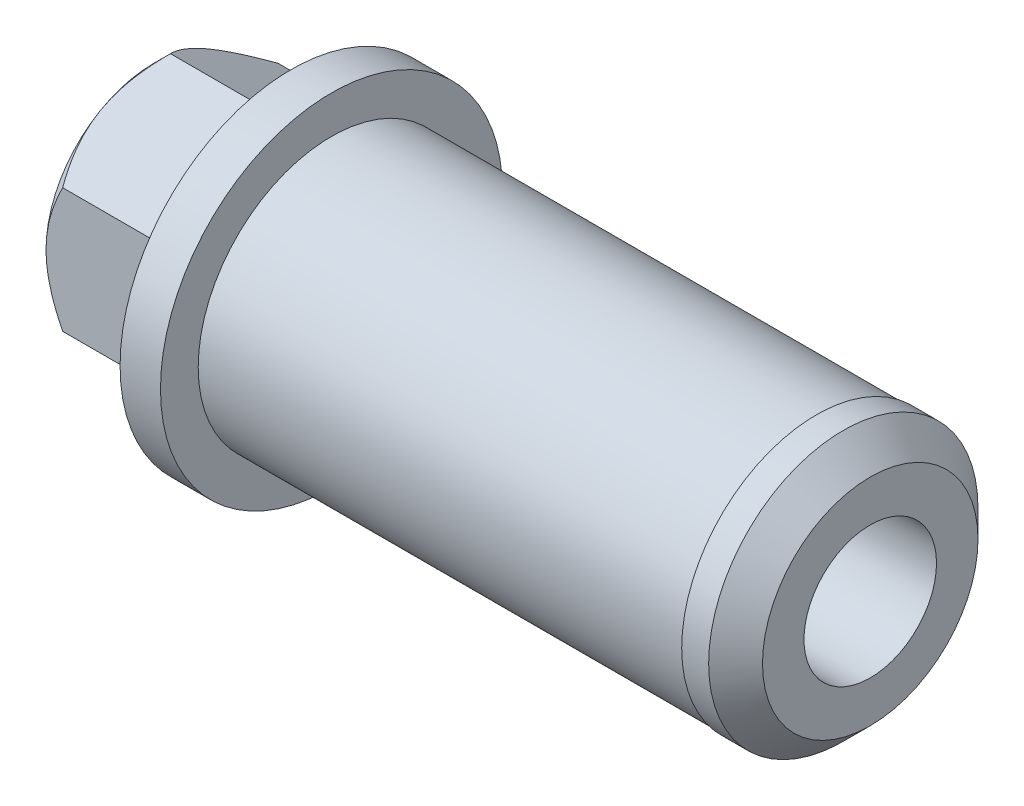
ISO-10303-21;
HEADER;
FILE_DESCRIPTION(('STEP AP214'),'2;1');
FILE_NAME('part.step','',(''),(''),'','','');
FILE_SCHEMA(('AUTOMOTIVE_DESIGN { 1 0 10303 214 1 1 1 1 }'));
ENDSEC;
DATA;
#1=APPLICATION_CONTEXT('core data for automotive mechanical design processes');
#2=APPLICATION_PROTOCOL_DEFINITION('international standard','automotive_design',2000,#1);
#3=PRODUCT_CONTEXT('',#1,'mechanical');
#4=PRODUCT('Part','Part','',(#3));
#5=PRODUCT_RELATED_PRODUCT_CATEGORY('part','',(#4));
#6=PRODUCT_DEFINITION_FORMATION('','',#4);
#7=PRODUCT_DEFINITION_CONTEXT('part definition',#1,'design');
#8=PRODUCT_DEFINITION('design','',#6,#7);
#9=PRODUCT_DEFINITION_SHAPE('','',#8);
#10=(LENGTH_UNIT() NAMED_UNIT(*) SI_UNIT(.MILLI.,.METRE.));
#11=(NAMED_UNIT(*) PLANE_ANGLE_UNIT() SI_UNIT($,.RADIAN.));
#12=(NAMED_UNIT(*) SI_UNIT($,.STERADIAN.) SOLID_ANGLE_UNIT());
#13=UNCERTAINTY_MEASURE_WITH_UNIT(LENGTH_MEASURE(1.E-05),#10,'distance_accuracy_value','');
#14=(GEOMETRIC_REPRESENTATION_CONTEXT(3) GLOBAL_UNCERTAINTY_ASSIGNED_CONTEXT((#13)) GLOBAL_UNIT_ASSIGNED_CONTEXT((#10,
#11,#12)) REPRESENTATION_CONTEXT('',''));
#15=CARTESIAN_POINT('',(0.,0.,0.));
#16=DIRECTION('',(0.,0.,1.));
#17=DIRECTION('',(1.,0.,0.));
#18=AXIS2_PLACEMENT_3D('',#15,#16,#17);
#19=CARTESIAN_POINT('',(-5.1,0.,0.));
#20=DIRECTION('',(-1.,0.,0.));
#21=DIRECTION('',(0.,0.,-1.));
#22=AXIS2_PLACEMENT_3D('',#19,#20,#21);
#23=PLANE('',#22);
#24=CARTESIAN_POINT('',(-5.1,0.,0.));
#25=DIRECTION('',(1.,0.,0.));
#26=DIRECTION('',(0.,0.,-1.));
#27=AXIS2_PLACEMENT_3D('',#24,#25,#26);
#28=CIRCLE('',#27,2.96);
#29=CARTESIAN_POINT('',(-5.1,0.,-2.96));
#30=VERTEX_POINT('',#29);
#31=EDGE_CURVE('E11',#30,#30,#28,.F.);
#32=ORIENTED_EDGE('',*,*,#31,.F.);
#33=EDGE_LOOP('',(#32));
#34=FACE_BOUND('',#33,.T.);
#35=CARTESIAN_POINT('',(-5.1,0.,0.));
#36=DIRECTION('',(-1.,0.,0.));
#37=DIRECTION('',(0.,0.,1.));
#38=AXIS2_PLACEMENT_3D('',#35,#36,#37);
#39=CIRCLE('',#38,4.);
#40=CARTESIAN_POINT('',(-5.1,0.,-4.));
#41=VERTEX_POINT('',#40);
#42=CARTESIAN_POINT('',(-5.1,-3.46410161513775,-2.));
#43=VERTEX_POINT('',#42);
#44=EDGE_CURVE('E266',#41,#43,#39,.T.);
#45=ORIENTED_EDGE('',*,*,#44,.T.);
#46=CARTESIAN_POINT('',(-5.1,-3.46410161513776,2.));
#47=VERTEX_POINT('',#46);
#48=EDGE_CURVE('E268',#43,#47,#39,.T.);
#49=ORIENTED_EDGE('',*,*,#48,.T.);
#50=CARTESIAN_POINT('',(-5.1,0.,4.));
#51=VERTEX_POINT('',#50);
#52=EDGE_CURVE('E273',#47,#51,#39,.T.);
#53=ORIENTED_EDGE('',*,*,#52,.T.);
#54=CARTESIAN_POINT('',(-5.1,3.46410161513775,2.));
#55=VERTEX_POINT('',#54);
#56=EDGE_CURVE('E113',#51,#55,#39,.T.);
#57=ORIENTED_EDGE('',*,*,#56,.T.);
#58=CARTESIAN_POINT('',(-5.1,3.46410161513776,-2.));
#59=VERTEX_POINT('',#58);
#60=EDGE_CURVE('E272',#55,#59,#39,.T.);
#61=ORIENTED_EDGE('',*,*,#60,.T.);
#62=EDGE_CURVE('E270',#59,#41,#39,.T.);
#63=ORIENTED_EDGE('',*,*,#62,.T.);
#64=EDGE_LOOP('',(#45,#49,#53,#57,#61,#63));
#65=FACE_BOUND('',#64,.T.);
#66=ADVANCED_FACE('F39',(#34,#65),#23,.T.);
#67=CARTESIAN_POINT('',(0.,0.,2.46));
#68=DIRECTION('',(1.,0.,0.));
#69=DIRECTION('',(0.,0.,1.));
#70=AXIS2_PLACEMENT_3D('',#67,#68,#69);
#71=PLANE('',#70);
#72=CARTESIAN_POINT('',(0.,0.,0.));
#73=DIRECTION('',(1.,0.,0.));
#74=DIRECTION('',(0.,0.,-1.));
#75=AXIS2_PLACEMENT_3D('',#72,#73,#74);
#76=CIRCLE('',#75,6.35);
#77=CARTESIAN_POINT('',(0.,0.,-6.35));
#78=VERTEX_POINT('',#77);
#79=EDGE_CURVE('E162',#78,#78,#76,.T.);
#80=ORIENTED_EDGE('',*,*,#79,.F.);
#81=EDGE_LOOP('',(#80));
#82=FACE_BOUND('',#81,.T.);
#83=DIRECTION('',(0.,0.500000000000001,-0.866025403784438));
#84=VECTOR('',#83,1.);
#85=CARTESIAN_POINT('',(0.,-4.61880215351701,0.));
#86=LINE('',#85,#84);
#87=CARTESIAN_POINT('',(0.,-4.61880215351701,0.));
#88=VERTEX_POINT('',#87);
#89=CARTESIAN_POINT('',(0.,-2.3094010767585,-4.));
#90=VERTEX_POINT('',#89);
#91=EDGE_CURVE('E280',#88,#90,#86,.T.);
#92=ORIENTED_EDGE('',*,*,#91,.T.);
#93=DIRECTION('',(0.,1.,0.));
#94=VECTOR('',#93,1.);
#95=CARTESIAN_POINT('',(0.,-2.3094010767585,-4.));
#96=LINE('',#95,#94);
#97=CARTESIAN_POINT('',(0.,2.30940107675851,-4.));
#98=VERTEX_POINT('',#97);
#99=EDGE_CURVE('E320',#90,#98,#96,.T.);
#100=ORIENTED_EDGE('',*,*,#99,.T.);
#101=DIRECTION('',(0.,0.5,0.866025403784439));
#102=VECTOR('',#101,1.);
#103=CARTESIAN_POINT('',(0.,2.30940107675851,-4.));
#104=LINE('',#103,#102);
#105=CARTESIAN_POINT('',(0.,4.61880215351701,0.));
#106=VERTEX_POINT('',#105);
#107=EDGE_CURVE('E316',#98,#106,#104,.T.);
#108=ORIENTED_EDGE('',*,*,#107,.T.);
#109=DIRECTION('',(0.,-0.500000000000001,0.866025403784438));
#110=VECTOR('',#109,1.);
#111=CARTESIAN_POINT('',(0.,4.61880215351701,0.));
#112=LINE('',#111,#110);
#113=CARTESIAN_POINT('',(0.,2.3094010767585,4.));
#114=VERTEX_POINT('',#113);
#115=EDGE_CURVE('E314',#106,#114,#112,.T.);
#116=ORIENTED_EDGE('',*,*,#115,.T.);
#117=DIRECTION('',(0.,-1.,0.));
#118=VECTOR('',#117,1.);
#119=CARTESIAN_POINT('',(0.,2.3094010767585,4.));
#120=LINE('',#119,#118);
#121=CARTESIAN_POINT('',(0.,-2.3094010767585,4.));
#122=VERTEX_POINT('',#121);
#123=EDGE_CURVE('E133',#114,#122,#120,.T.);
#124=ORIENTED_EDGE('',*,*,#123,.T.);
#125=DIRECTION('',(0.,-0.5,-0.866025403784438));
#126=VECTOR('',#125,1.);
#127=CARTESIAN_POINT('',(0.,-2.3094010767585,4.));
#128=LINE('',#127,#126);
#129=EDGE_CURVE('E307',#122,#88,#128,.T.);
#130=ORIENTED_EDGE('',*,*,#129,.T.);
#131=EDGE_LOOP('',(#92,#100,#108,#116,#124,#130));
#132=FACE_BOUND('',#131,.T.);
#133=ADVANCED_FACE('F245',(#82,#132),#71,.F.);
#134=CARTESIAN_POINT('',(0.,0.,0.));
#135=DIRECTION('',(-1.,0.,0.));
#136=DIRECTION('',(0.,0.,-1.));
#137=AXIS2_PLACEMENT_3D('',#134,#135,#136);
#138=CYLINDRICAL_SURFACE('',#137,2.46);
#139=CARTESIAN_POINT('',(-4.6,0.,0.));
#140=DIRECTION('',(1.,0.,0.));
#141=DIRECTION('',(0.,0.,-1.));
#142=AXIS2_PLACEMENT_3D('',#139,#140,#141);
#143=CIRCLE('',#142,2.46);
#144=CARTESIAN_POINT('',(-4.6,0.,-2.46));
#145=VERTEX_POINT('',#144);
#146=EDGE_CURVE('E47',#145,#145,#143,.T.);
#147=ORIENTED_EDGE('',*,*,#146,.F.);
#148=EDGE_LOOP('',(#147));
#149=FACE_BOUND('',#148,.T.);
#150=CARTESIAN_POINT('',(21.5,0.,0.));
#151=DIRECTION('',(1.,0.,0.));
#152=DIRECTION('',(0.,0.,-1.));
#153=AXIS2_PLACEMENT_3D('',#150,#151,#152);
#154=CIRCLE('',#153,2.46);
#155=CARTESIAN_POINT('',(21.5,0.,-2.46));
#156=VERTEX_POINT('',#155);
#157=EDGE_CURVE('E147',#156,#156,#154,.T.);
#158=ORIENTED_EDGE('',*,*,#157,.T.);
#159=EDGE_LOOP('',(#158));
#160=FACE_BOUND('',#159,.T.);
#161=ADVANCED_FACE('F243',(#149,#160),#138,.F.);
#162=CARTESIAN_POINT('',(0.,0.,0.));
#163=DIRECTION('',(-1.,0.,0.));
#164=DIRECTION('',(0.,0.,-1.));
#165=AXIS2_PLACEMENT_3D('',#162,#163,#164);
#166=CYLINDRICAL_SURFACE('',#165,6.35);
#167=ORIENTED_EDGE('',*,*,#79,.T.);
#168=EDGE_LOOP('',(#167));
#169=FACE_BOUND('',#168,.T.);
#170=CARTESIAN_POINT('',(1.5,0.,0.));
#171=DIRECTION('',(1.,0.,0.));
#172=DIRECTION('',(0.,0.,-1.));
#173=AXIS2_PLACEMENT_3D('',#170,#171,#172);
#174=CIRCLE('',#173,6.35);
#175=CARTESIAN_POINT('',(1.5,0.,-6.35));
#176=VERTEX_POINT('',#175);
#177=EDGE_CURVE('E159',#176,#176,#174,.T.);
#178=ORIENTED_EDGE('',*,*,#177,.F.);
#179=EDGE_LOOP('',(#178));
#180=FACE_BOUND('',#179,.T.);
#181=ADVANCED_FACE('F239',(#169,#180),#166,.T.);
#182=CARTESIAN_POINT('',(1.5,0.,6.35));
#183=DIRECTION('',(-1.,0.,0.));
#184=DIRECTION('',(0.,0.,-1.));
#185=AXIS2_PLACEMENT_3D('',#182,#183,#184);
#186=PLANE('',#185);
#187=ORIENTED_EDGE('',*,*,#177,.T.);
#188=EDGE_LOOP('',(#187));
#189=FACE_BOUND('',#188,.T.);
#190=CARTESIAN_POINT('',(1.5,0.,0.));
#191=DIRECTION('',(1.,0.,0.));
#192=DIRECTION('',(0.,0.,-1.));
#193=AXIS2_PLACEMENT_3D('',#190,#191,#192);
#194=CIRCLE('',#193,4.95);
#195=CARTESIAN_POINT('',(1.5,0.,-4.95));
#196=VERTEX_POINT('',#195);
#197=EDGE_CURVE('E156',#196,#196,#194,.T.);
#198=ORIENTED_EDGE('',*,*,#197,.F.);
#199=EDGE_LOOP('',(#198));
#200=FACE_BOUND('',#199,.T.);
#201=ADVANCED_FACE('F235',(#189,#200),#186,.F.);
#202=CARTESIAN_POINT('',(0.,0.,0.));
#203=DIRECTION('',(-1.,0.,0.));
#204=DIRECTION('',(0.,0.,-1.));
#205=AXIS2_PLACEMENT_3D('',#202,#203,#204);
#206=CYLINDRICAL_SURFACE('',#205,4.95);
#207=ORIENTED_EDGE('',*,*,#197,.T.);
#208=EDGE_LOOP('',(#207));
#209=FACE_BOUND('',#208,.T.);
#210=CARTESIAN_POINT('',(19.5,0.,0.));
#211=DIRECTION('',(1.,0.,0.));
#212=DIRECTION('',(0.,0.,-1.));
#213=AXIS2_PLACEMENT_3D('',#210,#211,#212);
#214=CIRCLE('',#213,4.95);
#215=CARTESIAN_POINT('',(19.5,0.,-4.95));
#216=VERTEX_POINT('',#215);
#217=EDGE_CURVE('E153',#216,#216,#214,.T.);
#218=ORIENTED_EDGE('',*,*,#217,.F.);
#219=EDGE_LOOP('',(#218));
#220=FACE_BOUND('',#219,.T.);
#221=ADVANCED_FACE('F231',(#209,#220),#206,.T.);
#222=CARTESIAN_POINT('',(19.5,0.,4.95));
#223=DIRECTION('',(1.,0.,0.));
#224=DIRECTION('',(0.,0.,1.));
#225=AXIS2_PLACEMENT_3D('',#222,#223,#224);
#226=PLANE('',#225);
#227=ORIENTED_EDGE('',*,*,#217,.T.);
#228=EDGE_LOOP('',(#227));
#229=FACE_BOUND('',#228,.T.);
#230=CARTESIAN_POINT('',(19.5,0.,0.));
#231=DIRECTION('',(1.,0.,0.));
#232=DIRECTION('',(0.,0.,-1.));
#233=AXIS2_PLACEMENT_3D('',#230,#231,#232);
#234=CIRCLE('',#233,5.);
#235=CARTESIAN_POINT('',(19.5,0.,-5.));
#236=VERTEX_POINT('',#235);
#237=EDGE_CURVE('E150',#236,#236,#234,.T.);
#238=ORIENTED_EDGE('',*,*,#237,.F.);
#239=EDGE_LOOP('',(#238));
#240=FACE_BOUND('',#239,.T.);
#241=ADVANCED_FACE('F227',(#229,#240),#226,.F.);
#242=CARTESIAN_POINT('',(0.,0.,0.));
#243=DIRECTION('',(-1.,0.,0.));
#244=DIRECTION('',(0.,0.,-1.));
#245=AXIS2_PLACEMENT_3D('',#242,#243,#244);
#246=CYLINDRICAL_SURFACE('',#245,5.);
#247=CARTESIAN_POINT('',(20.5,0.,0.));
#248=DIRECTION('',(1.,0.,0.));
#249=DIRECTION('',(0.,0.,-1.));
#250=AXIS2_PLACEMENT_3D('',#247,#248,#249);
#251=CIRCLE('',#250,5.);
#252=CARTESIAN_POINT('',(20.5,0.,-5.));
#253=VERTEX_POINT('',#252);
#254=EDGE_CURVE('E165',#253,#253,#251,.T.);
#255=ORIENTED_EDGE('',*,*,#254,.F.);
#256=EDGE_LOOP('',(#255));
#257=FACE_BOUND('',#256,.T.);
#258=ORIENTED_EDGE('',*,*,#237,.T.);
#259=EDGE_LOOP('',(#258));
#260=FACE_BOUND('',#259,.T.);
#261=ADVANCED_FACE('F223',(#257,#260),#246,.T.);
#262=CARTESIAN_POINT('',(21.5,0.,5.));
#263=DIRECTION('',(-1.,0.,0.));
#264=DIRECTION('',(0.,0.,-1.));
#265=AXIS2_PLACEMENT_3D('',#262,#263,#264);
#266=PLANE('',#265);
#267=CARTESIAN_POINT('',(21.5,0.,0.));
#268=DIRECTION('',(1.,0.,0.));
#269=DIRECTION('',(0.,0.,-1.));
#270=AXIS2_PLACEMENT_3D('',#267,#268,#269);
#271=CIRCLE('',#270,4.);
#272=CARTESIAN_POINT('',(21.5,0.,-4.));
#273=VERTEX_POINT('',#272);
#274=EDGE_CURVE('E168',#273,#273,#271,.F.);
#275=ORIENTED_EDGE('',*,*,#274,.F.);
#276=EDGE_LOOP('',(#275));
#277=FACE_BOUND('',#276,.T.);
#278=ORIENTED_EDGE('',*,*,#157,.F.);
#279=EDGE_LOOP('',(#278));
#280=FACE_BOUND('',#279,.T.);
#281=ADVANCED_FACE('F220',(#277,#280),#266,.F.);
#282=CARTESIAN_POINT('',(20.5,0.,0.));
#283=DIRECTION('',(-1.,0.,0.));
#284=DIRECTION('',(0.,0.,-1.));
#285=AXIS2_PLACEMENT_3D('',#282,#283,#284);
#286=CONICAL_SURFACE('',#285,5.,0.78539816339745);
#287=ORIENTED_EDGE('',*,*,#274,.T.);
#288=EDGE_LOOP('',(#287));
#289=FACE_BOUND('',#288,.T.);
#290=ORIENTED_EDGE('',*,*,#254,.T.);
#291=EDGE_LOOP('',(#290));
#292=FACE_BOUND('',#291,.T.);
#293=ADVANCED_FACE('F217',(#289,#292),#286,.T.);
#294=CARTESIAN_POINT('',(-5.1,-4.61880215351701,0.));
#295=DIRECTION('',(0.,0.866025403784438,0.500000000000001));
#296=DIRECTION('',(0.,0.500000000000001,-0.866025403784438));
#297=AXIS2_PLACEMENT_3D('',#294,#295,#296);
#298=PLANE('',#297);
#299=DIRECTION('',(1.,0.,0.));
#300=VECTOR('',#299,1.);
#301=CARTESIAN_POINT('',(-5.1,-2.3094010767585,-4.));
#302=LINE('',#301,#300);
#303=CARTESIAN_POINT('',(-4.48119784648299,-2.3094010767585,-4.));
#304=VERTEX_POINT('',#303);
#305=EDGE_CURVE('E145',#304,#90,#302,.T.);
#306=ORIENTED_EDGE('',*,*,#305,.T.);
#307=ORIENTED_EDGE('',*,*,#91,.F.);
#308=DIRECTION('',(1.,0.,0.));
#309=VECTOR('',#308,1.);
#310=CARTESIAN_POINT('',(-5.1,-4.61880215351701,0.));
#311=LINE('',#310,#309);
#312=CARTESIAN_POINT('',(-4.48119784648299,-4.61880215351701,0.));
#313=VERTEX_POINT('',#312);
#314=EDGE_CURVE('E140',#313,#88,#311,.T.);
#315=ORIENTED_EDGE('',*,*,#314,.F.);
#316=CARTESIAN_POINT('',(-4.48108237209913,-2.30928560670466,-4.0002));
#317=CARTESIAN_POINT('',(-4.52078899052543,-2.34899632674695,-3.93141901528162));
#318=CARTESIAN_POINT('',(-4.55927742936984,-2.3890109267086,-3.8621116951035));
#319=CARTESIAN_POINT('',(-4.63344662274748,-2.46971048312824,-3.72233596323641));
#320=CARTESIAN_POINT('',(-4.66912584375135,-2.51039579126537,-3.6518669424213));
#321=CARTESIAN_POINT('',(-4.771696978832,-2.63392971018402,-3.4378999183961));
#322=CARTESIAN_POINT('',(-4.83368473547043,-2.71782823500144,-3.29258341073226));
#323=CARTESIAN_POINT('',(-4.93984197747359,-2.88698352725106,-2.99959785018676));
#324=CARTESIAN_POINT('',(-4.98427879102956,-2.97219756726617,-2.85200280336237));
#325=CARTESIAN_POINT('',(-5.05274886435355,-3.14450730387842,-2.55355358491115));
#326=CARTESIAN_POINT('',(-5.07683320862169,-3.2315977233138,-2.40270855359658));
#327=CARTESIAN_POINT('',(-5.09856296562247,-3.38169462438279,-2.14273309488646));
#328=CARTESIAN_POINT('',(-5.10177893184214,-3.44450772236845,-2.03393761779449));
#329=CARTESIAN_POINT('',(-5.096357788258,-3.57003196860171,-1.8165232457367));
#330=CARTESIAN_POINT('',(-5.08771652331117,-3.63274307339631,-1.70790442603367));
#331=CARTESIAN_POINT('',(-5.05907380798657,-3.75757108217469,-1.49169597262187));
#332=CARTESIAN_POINT('',(-5.03905965193174,-3.81968724243513,-1.3841076270797));
#333=CARTESIAN_POINT('',(-4.98876368911835,-3.94285275199685,-1.17077870677869));
#334=CARTESIAN_POINT('',(-4.95848266960464,-4.00390218271575,-1.06503799100039));
#335=CARTESIAN_POINT('',(-4.89618259378878,-4.11227961083265,-0.877322779108272));
#336=CARTESIAN_POINT('',(-4.8658015666229,-4.15984755582568,-0.79493268156872));
#337=CARTESIAN_POINT('',(-4.80014338192266,-4.25412951504788,-0.631631537958729));
#338=CARTESIAN_POINT('',(-4.76486607544322,-4.30084350325071,-0.550720536967258));
#339=CARTESIAN_POINT('',(-4.69020615946207,-4.39327037218423,-0.390632503989882));
#340=CARTESIAN_POINT('',(-4.6508364594794,-4.43898588170052,-0.311450918813774));
#341=CARTESIAN_POINT('',(-4.5685087383397,-4.52957030284816,-0.154554099011851));
#342=CARTESIAN_POINT('',(-4.52555291868104,-4.57443971345263,-0.0768380001392379));
#343=CARTESIAN_POINT('',(-4.48108237209913,-4.61891762357085,0.000200000000000058));
#344=B_SPLINE_CURVE_WITH_KNOTS('',3,(#316,#317,#318,#319,#320,#321,#322,#323,#324,#325,#326,
#327,#328,#329,#330,#331,#332,#333,#334,#335,#336,#337,#338,#339,#340,#341,#342,#343),
.UNSPECIFIED.,.F.,.F.,(4,2,2,2,2,2,2,2,2,2,2,2,2,4),(0.,0.266361961703662,0.532868334400107,
1.06875865685461,1.59613884594049,2.12219135055578,2.49866160599655,2.87526382203491,
3.25228760372073,3.62928248242853,3.92874944437158,4.22822551811343,4.52678401907573,
4.82516056577922),.UNSPECIFIED.);
#345=EDGE_CURVE('E199',#43,#313,#344,.T.);
#346=ORIENTED_EDGE('',*,*,#345,.F.);
#347=EDGE_CURVE('E118',#304,#43,#344,.T.);
#348=ORIENTED_EDGE('',*,*,#347,.F.);
#349=EDGE_LOOP('',(#306,#307,#315,#346,#348));
#350=FACE_BOUND('',#349,.T.);
#351=ADVANCED_FACE('F211',(#350),#298,.F.);
#352=CARTESIAN_POINT('',(-5.1,-2.3094010767585,-4.));
#353=DIRECTION('',(0.,0.,1.));
#354=DIRECTION('',(0.,1.,0.));
#355=AXIS2_PLACEMENT_3D('',#352,#353,#354);
#356=PLANE('',#355);
#357=DIRECTION('',(1.,0.,0.));
#358=VECTOR('',#357,1.);
#359=CARTESIAN_POINT('',(-5.1,2.30940107675851,-4.));
#360=LINE('',#359,#358);
#361=CARTESIAN_POINT('',(-4.48119784648299,2.30940107675851,-4.));
#362=VERTEX_POINT('',#361);
#363=EDGE_CURVE('E138',#362,#98,#360,.T.);
#364=ORIENTED_EDGE('',*,*,#363,.T.);
#365=ORIENTED_EDGE('',*,*,#99,.F.);
#366=ORIENTED_EDGE('',*,*,#305,.F.);
#367=CARTESIAN_POINT('',(-2.83678461128598,-4.81952974940749,-4.));
#368=CARTESIAN_POINT('',(-2.92636294215643,-4.70309216754233,-4.));
#369=CARTESIAN_POINT('',(-3.0151385844768,-4.58602719829636,-4.));
#370=CARTESIAN_POINT('',(-3.19071777282994,-4.3503860512202,-4.));
#371=CARTESIAN_POINT('',(-3.27752084732042,-4.2318095224096,-4.));
#372=CARTESIAN_POINT('',(-3.44940591008956,-3.99202229936412,-4.));
#373=CARTESIAN_POINT('',(-3.53446945415143,-3.870798340518,-4.));
#374=CARTESIAN_POINT('',(-3.70163630821028,-3.62633290119854,-4.));
#375=CARTESIAN_POINT('',(-3.78373982203724,-3.50309156049674,-4.));
#376=CARTESIAN_POINT('',(-3.9494032576463,-3.24636255832609,-4.));
#377=CARTESIAN_POINT('',(-4.03272542085204,-3.11272070106124,-4.));
#378=CARTESIAN_POINT('',(-4.19419807093999,-2.84229861383361,-4.));
#379=CARTESIAN_POINT('',(-4.27234768747635,-2.70551786090031,-4.));
#380=CARTESIAN_POINT('',(-4.42181093937827,-2.42878056467515,-4.));
#381=CARTESIAN_POINT('',(-4.49314464180467,-2.28883494483992,-4.));
#382=CARTESIAN_POINT('',(-4.62737784917563,-2.00498757663521,-4.));
#383=CARTESIAN_POINT('',(-4.69028133290693,-1.86108773344898,-4.));
#384=CARTESIAN_POINT('',(-4.79969473675121,-1.58342893734174,-4.));
#385=CARTESIAN_POINT('',(-4.84720974257752,-1.45007011340975,-4.));
#386=CARTESIAN_POINT('',(-4.93156519966147,-1.17995488398092,-4.));
#387=CARTESIAN_POINT('',(-4.9684049710111,-1.04319826267965,-4.));
#388=CARTESIAN_POINT('',(-5.02880179499581,-0.769486022613106,-4.));
#389=CARTESIAN_POINT('',(-5.05260009552649,-0.632584546895031,-4.));
#390=CARTESIAN_POINT('',(-5.08641750108615,-0.357080709123292,-4.));
#391=CARTESIAN_POINT('',(-5.0964394649071,-0.218478705978884,-4.));
#392=CARTESIAN_POINT('',(-5.10185050690913,0.0529507020266497,-4.));
#393=CARTESIAN_POINT('',(-5.09785970827475,0.185765859834694,-4.));
#394=CARTESIAN_POINT('',(-5.07688915629962,0.450359747774035,-4.));
#395=CARTESIAN_POINT('',(-5.05990822315386,0.58213838266669,-4.));
#396=CARTESIAN_POINT('',(-5.01362892534461,0.845938834838876,-4.));
#397=CARTESIAN_POINT('',(-4.98411309442168,0.977921849267815,-4.));
#398=CARTESIAN_POINT('',(-4.91440150126756,1.23898137971302,-4.));
#399=CARTESIAN_POINT('',(-4.87420634560922,1.36805806035403,-4.));
#400=CARTESIAN_POINT('',(-4.78232848947368,1.63041586420204,-4.));
#401=CARTESIAN_POINT('',(-4.7301165772418,1.76350953495664,-4.));
#402=CARTESIAN_POINT('',(-4.61762635793245,2.02627346027599,-4.));
#403=CARTESIAN_POINT('',(-4.55734441370411,2.15594213946629,-4.));
#404=CARTESIAN_POINT('',(-4.43014370377874,2.41246844986754,-4.));
#405=CARTESIAN_POINT('',(-4.3632044965674,2.5393158620577,-4.));
#406=CARTESIAN_POINT('',(-4.22416233280143,2.79010403830294,-4.));
#407=CARTESIAN_POINT('',(-4.15206017130905,2.91404524600961,-4.));
#408=CARTESIAN_POINT('',(-4.00736310939975,3.15334336234392,-4.));
#409=CARTESIAN_POINT('',(-3.93496836401797,3.26882194216559,-4.));
#410=CARTESIAN_POINT('',(-3.78709738827001,3.49779509299912,-4.));
#411=CARTESIAN_POINT('',(-3.71162092687163,3.61128951434694,-4.));
#412=CARTESIAN_POINT('',(-3.55875050944935,3.8356414491525,-4.));
#413=CARTESIAN_POINT('',(-3.48137681420984,3.94651281785068,-4.));
#414=CARTESIAN_POINT('',(-3.32455530734092,4.16673455070892,-4.));
#415=CARTESIAN_POINT('',(-3.24510807335263,4.27608532573151,-4.));
#416=CARTESIAN_POINT('',(-3.16481208632949,4.38479823601728,-4.));
#417=B_SPLINE_CURVE_WITH_KNOTS('',3,(#367,#368,#369,#370,#371,#372,#373,#374,#375,#376,#377,
#378,#379,#380,#381,#382,#383,#384,#385,#386,#387,#388,#389,#390,#391,#392,#393,#394,#395,#396,
#397,#398,#399,#400,#401,#402,#403,#404,#405,#406,#407,#408,#409,#410,#411,#412,#413,#414,#415,
#416),.UNSPECIFIED.,.F.,.F.,(4,2,2,2,2,2,2,2,2,2,2,2,2,2,2,2,2,2,2,2,2,2,2,2,4),(0.,
0.440732365063031,0.881569001863996,1.32580660852613,1.77001356598453,2.24238695696789,
2.71483962969296,3.18585545909472,3.65664819565422,4.08099413126666,4.50536708762677,
4.9215992232885,5.33774497163005,5.73571105165653,6.13371328051046,6.53892220218653,
6.94410811339989,7.37268518912191,7.80145607828324,8.23158675780794,8.66165134179226,
9.07047872649948,9.47933681693734,9.8849122325451,10.2903758451868),.UNSPECIFIED.);
#418=EDGE_CURVE('E129',#41,#304,#417,.F.);
#419=ORIENTED_EDGE('',*,*,#418,.F.);
#420=EDGE_CURVE('E54',#362,#41,#417,.F.);
#421=ORIENTED_EDGE('',*,*,#420,.F.);
#422=EDGE_LOOP('',(#364,#365,#366,#419,#421));
#423=FACE_BOUND('',#422,.T.);
#424=ADVANCED_FACE('F216',(#423),#356,.F.);
#425=CARTESIAN_POINT('',(-5.1,2.30940107675851,-4.));
#426=DIRECTION('',(0.,-0.866025403784439,0.5));
#427=DIRECTION('',(0.,0.5,0.866025403784439));
#428=AXIS2_PLACEMENT_3D('',#425,#426,#427);
#429=PLANE('',#428);
#430=DIRECTION('',(1.,0.,0.));
#431=VECTOR('',#430,1.);
#432=CARTESIAN_POINT('',(-5.1,4.61880215351701,0.));
#433=LINE('',#432,#431);
#434=CARTESIAN_POINT('',(-4.48119784648299,4.61880215351701,0.));
#435=VERTEX_POINT('',#434);
#436=EDGE_CURVE('E135',#435,#106,#433,.T.);
#437=ORIENTED_EDGE('',*,*,#436,.T.);
#438=ORIENTED_EDGE('',*,*,#107,.F.);
#439=ORIENTED_EDGE('',*,*,#363,.F.);
#440=CARTESIAN_POINT('',(-4.48108237209913,4.61891762357085,0.0002));
#441=CARTESIAN_POINT('',(-4.52078899052543,4.57920690352856,-0.0685809847183836));
#442=CARTESIAN_POINT('',(-4.55927742936984,4.53919230356691,-0.137888304896501));
#443=CARTESIAN_POINT('',(-4.63344662274748,4.45849274714727,-0.277664036763592));
#444=CARTESIAN_POINT('',(-4.66912584375135,4.41780743901014,-0.348133057578702));
#445=CARTESIAN_POINT('',(-4.771696978832,4.29427352009149,-0.562100081603898));
#446=CARTESIAN_POINT('',(-4.83368473547043,4.21037499527407,-0.707416589267739));
#447=CARTESIAN_POINT('',(-4.93984197747359,4.04121970302445,-1.00040214981325));
#448=CARTESIAN_POINT('',(-4.98427879102955,3.95600566300933,-1.14799719663763));
#449=CARTESIAN_POINT('',(-5.05274886435354,3.78369592639709,-1.44644641508886));
#450=CARTESIAN_POINT('',(-5.07683320862169,3.6966055069617,-1.59729144640342));
#451=CARTESIAN_POINT('',(-5.09856296562246,3.54650860589272,-1.85726690511354));
#452=CARTESIAN_POINT('',(-5.10177893184214,3.48369550790706,-1.96606238220551));
#453=CARTESIAN_POINT('',(-5.09635778825799,3.3581712616738,-2.18347675426331));
#454=CARTESIAN_POINT('',(-5.08771652331117,3.2954601568792,-2.29209557396633));
#455=CARTESIAN_POINT('',(-5.05907380798657,3.17063214810082,-2.50830402737813));
#456=CARTESIAN_POINT('',(-5.03905965193174,3.10851598784038,-2.61589237292031));
#457=CARTESIAN_POINT('',(-4.98876368911835,2.98535047827866,-2.82922129322132));
#458=CARTESIAN_POINT('',(-4.95848266960463,2.92430104755976,-2.93496200899961));
#459=CARTESIAN_POINT('',(-4.89618259378878,2.81592361944286,-3.12267722089173));
#460=CARTESIAN_POINT('',(-4.8658015666229,2.76835567444984,-3.20506731843128));
#461=CARTESIAN_POINT('',(-4.80014338192266,2.67407371522763,-3.36836846204127));
#462=CARTESIAN_POINT('',(-4.76486607544322,2.62735972702481,-3.44927946303274));
#463=CARTESIAN_POINT('',(-4.69020615946207,2.53493285809128,-3.60936749601012));
#464=CARTESIAN_POINT('',(-4.65083645947939,2.48921734857499,-3.68854908118623));
#465=CARTESIAN_POINT('',(-4.56850873833969,2.39863292742736,-3.84544590098815));
#466=CARTESIAN_POINT('',(-4.52555291868104,2.35376351682289,-3.92316199986076));
#467=CARTESIAN_POINT('',(-4.48108237209913,2.30928560670467,-4.0002));
#468=B_SPLINE_CURVE_WITH_KNOTS('',3,(#440,#441,#442,#443,#444,#445,#446,#447,#448,#449,#450,
#451,#452,#453,#454,#455,#456,#457,#458,#459,#460,#461,#462,#463,#464,#465,#466,#467),
.UNSPECIFIED.,.F.,.F.,(4,2,2,2,2,2,2,2,2,2,2,2,2,4),(0.,0.266361961703662,0.532868334400108,
1.06875865685461,1.59613884594049,2.12219135055579,2.49866160599656,2.87526382203491,
3.25228760372073,3.62928248242854,3.92874944437158,4.22822551811343,4.52678401907573,
4.82516056577922),.UNSPECIFIED.);
#469=EDGE_CURVE('E281',#59,#362,#468,.T.);
#470=ORIENTED_EDGE('',*,*,#469,.F.);
#471=EDGE_CURVE('E277',#435,#59,#468,.T.);
#472=ORIENTED_EDGE('',*,*,#471,.F.);
#473=EDGE_LOOP('',(#437,#438,#439,#470,#472));
#474=FACE_BOUND('',#473,.T.);
#475=ADVANCED_FACE('F284',(#474),#429,.F.);
#476=CARTESIAN_POINT('',(-5.1,4.61880215351701,0.));
#477=DIRECTION('',(0.,-0.866025403784438,-0.500000000000001));
#478=DIRECTION('',(0.,-0.500000000000001,0.866025403784438));
#479=AXIS2_PLACEMENT_3D('',#476,#477,#478);
#480=PLANE('',#479);
#481=DIRECTION('',(1.,0.,0.));
#482=VECTOR('',#481,1.);
#483=CARTESIAN_POINT('',(-5.1,2.3094010767585,4.));
#484=LINE('',#483,#482);
#485=CARTESIAN_POINT('',(-4.48119784648299,2.30940107675851,4.));
#486=VERTEX_POINT('',#485);
#487=EDGE_CURVE('E124',#486,#114,#484,.T.);
#488=ORIENTED_EDGE('',*,*,#487,.T.);
#489=ORIENTED_EDGE('',*,*,#115,.F.);
#490=ORIENTED_EDGE('',*,*,#436,.F.);
#491=CARTESIAN_POINT('',(-4.48108237209913,2.30928560670466,4.0002));
#492=CARTESIAN_POINT('',(-4.52078899052543,2.34899632674695,3.93141901528162));
#493=CARTESIAN_POINT('',(-4.55927742936984,2.3890109267086,3.8621116951035));
#494=CARTESIAN_POINT('',(-4.63344662274748,2.46971048312824,3.72233596323641));
#495=CARTESIAN_POINT('',(-4.66912584375135,2.51039579126537,3.6518669424213));
#496=CARTESIAN_POINT('',(-4.771696978832,2.63392971018402,3.4378999183961));
#497=CARTESIAN_POINT('',(-4.83368473547043,2.71782823500144,3.29258341073226));
#498=CARTESIAN_POINT('',(-4.93984197747359,2.88698352725106,2.99959785018676));
#499=CARTESIAN_POINT('',(-4.98427879102956,2.97219756726618,2.85200280336237));
#500=CARTESIAN_POINT('',(-5.05274886435355,3.14450730387842,2.55355358491115));
#501=CARTESIAN_POINT('',(-5.07683320862169,3.2315977233138,2.40270855359658));
#502=CARTESIAN_POINT('',(-5.09856296562246,3.38169462438279,2.14273309488646));
#503=CARTESIAN_POINT('',(-5.10177893184214,3.44450772236845,2.03393761779449));
#504=CARTESIAN_POINT('',(-5.096357788258,3.57003196860171,1.8165232457367));
#505=CARTESIAN_POINT('',(-5.08771652331117,3.63274307339631,1.70790442603367));
#506=CARTESIAN_POINT('',(-5.05907380798657,3.75757108217469,1.49169597262187));
#507=CARTESIAN_POINT('',(-5.03905965193174,3.81968724243513,1.3841076270797));
#508=CARTESIAN_POINT('',(-4.98876368911835,3.94285275199685,1.17077870677869));
#509=CARTESIAN_POINT('',(-4.95848266960464,4.00390218271575,1.06503799100039));
#510=CARTESIAN_POINT('',(-4.89618259378878,4.11227961083265,0.877322779108274));
#511=CARTESIAN_POINT('',(-4.8658015666229,4.15984755582568,0.794932681568721));
#512=CARTESIAN_POINT('',(-4.80014338192266,4.25412951504788,0.631631537958731));
#513=CARTESIAN_POINT('',(-4.76486607544322,4.30084350325071,0.55072053696726));
#514=CARTESIAN_POINT('',(-4.69020615946207,4.39327037218423,0.390632503989882));
#515=CARTESIAN_POINT('',(-4.6508364594794,4.43898588170052,0.311450918813774));
#516=CARTESIAN_POINT('',(-4.5685087383397,4.52957030284816,0.154554099011851));
#517=CARTESIAN_POINT('',(-4.52555291868104,4.57443971345263,0.0768380001392378));
#518=CARTESIAN_POINT('',(-4.48108237209913,4.61891762357085,-0.000200000000000015));
#519=B_SPLINE_CURVE_WITH_KNOTS('',3,(#491,#492,#493,#494,#495,#496,#497,#498,#499,#500,#501,
#502,#503,#504,#505,#506,#507,#508,#509,#510,#511,#512,#513,#514,#515,#516,#517,#518),
.UNSPECIFIED.,.F.,.F.,(4,2,2,2,2,2,2,2,2,2,2,2,2,4),(0.,0.266361961703661,0.532868334400106,
1.06875865685461,1.59613884594049,2.12219135055578,2.49866160599655,2.87526382203491,
3.25228760372072,3.62928248242853,3.92874944437157,4.22822551811343,4.52678401907573,
4.82516056577922),.UNSPECIFIED.);
#520=EDGE_CURVE('E127',#55,#435,#519,.T.);
#521=ORIENTED_EDGE('',*,*,#520,.F.);
#522=EDGE_CURVE('E62',#486,#55,#519,.T.);
#523=ORIENTED_EDGE('',*,*,#522,.F.);
#524=EDGE_LOOP('',(#488,#489,#490,#521,#523));
#525=FACE_BOUND('',#524,.T.);
#526=ADVANCED_FACE('F122',(#525),#480,.F.);
#527=CARTESIAN_POINT('',(-5.1,2.3094010767585,4.));
#528=DIRECTION('',(0.,0.,-1.));
#529=DIRECTION('',(0.,-1.,0.));
#530=AXIS2_PLACEMENT_3D('',#527,#528,#529);
#531=PLANE('',#530);
#532=DIRECTION('',(1.,0.,0.));
#533=VECTOR('',#532,1.);
#534=CARTESIAN_POINT('',(-5.1,-2.3094010767585,4.));
#535=LINE('',#534,#533);
#536=CARTESIAN_POINT('',(-4.48119784648299,-2.3094010767585,4.));
#537=VERTEX_POINT('',#536);
#538=EDGE_CURVE('E136',#537,#122,#535,.T.);
#539=ORIENTED_EDGE('',*,*,#538,.T.);
#540=ORIENTED_EDGE('',*,*,#123,.F.);
#541=ORIENTED_EDGE('',*,*,#487,.F.);
#542=CARTESIAN_POINT('',(-2.83678461128597,-4.81952974940751,4.));
#543=CARTESIAN_POINT('',(-2.92636294215643,-4.70309216754234,4.));
#544=CARTESIAN_POINT('',(-3.0151385844768,-4.58602719829638,4.));
#545=CARTESIAN_POINT('',(-3.19071777282993,-4.35038605122022,4.));
#546=CARTESIAN_POINT('',(-3.27752084732041,-4.23180952240962,4.));
#547=CARTESIAN_POINT('',(-3.44940591008955,-3.99202229936413,4.));
#548=CARTESIAN_POINT('',(-3.53446945415142,-3.87079834051801,4.));
#549=CARTESIAN_POINT('',(-3.70163630821027,-3.62633290119855,4.));
#550=CARTESIAN_POINT('',(-3.78373982203724,-3.50309156049675,4.));
#551=CARTESIAN_POINT('',(-3.9494032576463,-3.2463625583261,4.));
#552=CARTESIAN_POINT('',(-4.03272542085203,-3.11272070106125,4.));
#553=CARTESIAN_POINT('',(-4.19419807093999,-2.84229861383362,4.));
#554=CARTESIAN_POINT('',(-4.27234768747635,-2.70551786090031,4.));
#555=CARTESIAN_POINT('',(-4.42181093937827,-2.42878056467516,4.));
#556=CARTESIAN_POINT('',(-4.49314464180467,-2.28883494483992,4.));
#557=CARTESIAN_POINT('',(-4.62737784917563,-2.00498757663521,4.));
#558=CARTESIAN_POINT('',(-4.69028133290693,-1.86108773344899,4.));
#559=CARTESIAN_POINT('',(-4.79969473675121,-1.58342893734174,4.));
#560=CARTESIAN_POINT('',(-4.84720974257752,-1.45007011340975,4.));
#561=CARTESIAN_POINT('',(-4.93156519966147,-1.17995488398093,4.));
#562=CARTESIAN_POINT('',(-4.9684049710111,-1.04319826267965,4.));
#563=CARTESIAN_POINT('',(-5.02880179499581,-0.769486022613108,4.));
#564=CARTESIAN_POINT('',(-5.05260009552649,-0.632584546895033,4.));
#565=CARTESIAN_POINT('',(-5.08641750108615,-0.357080709123294,4.));
#566=CARTESIAN_POINT('',(-5.09643946490711,-0.218478705978886,4.));
#567=CARTESIAN_POINT('',(-5.10185050690914,0.0529507020266475,4.));
#568=CARTESIAN_POINT('',(-5.09785970827475,0.185765859834692,4.));
#569=CARTESIAN_POINT('',(-5.07688915629962,0.450359747774033,4.));
#570=CARTESIAN_POINT('',(-5.05990822315386,0.582138382666688,4.));
#571=CARTESIAN_POINT('',(-5.01362892534461,0.845938834838875,4.));
#572=CARTESIAN_POINT('',(-4.98411309442169,0.977921849267814,4.));
#573=CARTESIAN_POINT('',(-4.91440150126757,1.23898137971302,4.));
#574=CARTESIAN_POINT('',(-4.87420634560922,1.36805806035403,4.));
#575=CARTESIAN_POINT('',(-4.78232848947368,1.63041586420203,4.));
#576=CARTESIAN_POINT('',(-4.7301165772418,1.76350953495664,4.));
#577=CARTESIAN_POINT('',(-4.61762635793246,2.02627346027599,4.));
#578=CARTESIAN_POINT('',(-4.55734441370411,2.15594213946629,4.));
#579=CARTESIAN_POINT('',(-4.43014370377874,2.41246844986754,4.));
#580=CARTESIAN_POINT('',(-4.36320449656741,2.53931586205769,4.));
#581=CARTESIAN_POINT('',(-4.22416233280143,2.79010403830294,4.));
#582=CARTESIAN_POINT('',(-4.15206017130906,2.91404524600961,4.));
#583=CARTESIAN_POINT('',(-4.00736310939976,3.15334336234391,4.));
#584=CARTESIAN_POINT('',(-3.93496836401797,3.26882194216558,4.));
#585=CARTESIAN_POINT('',(-3.78709738827001,3.49779509299911,4.));
#586=CARTESIAN_POINT('',(-3.71162092687163,3.61128951434693,4.));
#587=CARTESIAN_POINT('',(-3.55875050944936,3.83564144915249,4.));
#588=CARTESIAN_POINT('',(-3.48137681420984,3.94651281785067,4.));
#589=CARTESIAN_POINT('',(-3.32455530734092,4.16673455070891,4.));
#590=CARTESIAN_POINT('',(-3.24510807335263,4.2760853257315,4.));
#591=CARTESIAN_POINT('',(-3.16481208632949,4.38479823601728,4.));
#592=B_SPLINE_CURVE_WITH_KNOTS('',3,(#542,#543,#544,#545,#546,#547,#548,#549,#550,#551,#552,
#553,#554,#555,#556,#557,#558,#559,#560,#561,#562,#563,#564,#565,#566,#567,#568,#569,#570,#571,
#572,#573,#574,#575,#576,#577,#578,#579,#580,#581,#582,#583,#584,#585,#586,#587,#588,#589,#590,
#591),.UNSPECIFIED.,.F.,.F.,(4,2,2,2,2,2,2,2,2,2,2,2,2,2,2,2,2,2,2,2,2,2,2,2,4),(0.,
0.44073236506303,0.881569001863997,1.32580660852613,1.77001356598453,2.24238695696789,
2.71483962969297,3.18585545909473,3.65664819565424,4.08099413126667,4.50536708762678,
4.92159922328851,5.33774497163006,5.73571105165654,6.13371328051048,6.53892220218655,
6.9441081133999,7.37268518912192,7.80145607828325,8.23158675780796,8.66165134179227,
9.07047872649949,9.47933681693735,9.88491223254511,10.2903758451868),.UNSPECIFIED.);
#593=EDGE_CURVE('E110',#51,#486,#592,.T.);
#594=ORIENTED_EDGE('',*,*,#593,.F.);
#595=EDGE_CURVE('E120',#537,#51,#592,.T.);
#596=ORIENTED_EDGE('',*,*,#595,.F.);
#597=EDGE_LOOP('',(#539,#540,#541,#594,#596));
#598=FACE_BOUND('',#597,.T.);
#599=ADVANCED_FACE('F131',(#598),#531,.F.);
#600=CARTESIAN_POINT('',(-5.1,-2.3094010767585,4.));
#601=DIRECTION('',(0.,0.866025403784439,-0.5));
#602=DIRECTION('',(0.,-0.5,-0.866025403784439));
#603=AXIS2_PLACEMENT_3D('',#600,#601,#602);
#604=PLANE('',#603);
#605=ORIENTED_EDGE('',*,*,#314,.T.);
#606=ORIENTED_EDGE('',*,*,#129,.F.);
#607=ORIENTED_EDGE('',*,*,#538,.F.);
#608=CARTESIAN_POINT('',(-4.48108237209913,-4.61891762357085,-0.000200000000000118));
#609=CARTESIAN_POINT('',(-4.52078899052543,-4.57920690352856,0.0685809847183828));
#610=CARTESIAN_POINT('',(-4.55927742936984,-4.53919230356691,0.1378883048965));
#611=CARTESIAN_POINT('',(-4.63344662274748,-4.45849274714727,0.277664036763592));
#612=CARTESIAN_POINT('',(-4.66912584375135,-4.41780743901014,0.348133057578702));
#613=CARTESIAN_POINT('',(-4.771696978832,-4.29427352009149,0.562100081603899));
#614=CARTESIAN_POINT('',(-4.83368473547043,-4.21037499527407,0.70741658926774));
#615=CARTESIAN_POINT('',(-4.93984197747359,-4.04121970302445,1.00040214981325));
#616=CARTESIAN_POINT('',(-4.98427879102955,-3.95600566300933,1.14799719663763));
#617=CARTESIAN_POINT('',(-5.05274886435354,-3.78369592639709,1.44644641508886));
#618=CARTESIAN_POINT('',(-5.07683320862169,-3.6966055069617,1.59729144640342));
#619=CARTESIAN_POINT('',(-5.09856296562246,-3.54650860589272,1.85726690511354));
#620=CARTESIAN_POINT('',(-5.10177893184214,-3.48369550790706,1.96606238220551));
#621=CARTESIAN_POINT('',(-5.096357788258,-3.3581712616738,2.18347675426331));
#622=CARTESIAN_POINT('',(-5.08771652331117,-3.29546015687919,2.29209557396633));
#623=CARTESIAN_POINT('',(-5.05907380798657,-3.17063214810082,2.50830402737813));
#624=CARTESIAN_POINT('',(-5.03905965193174,-3.10851598784038,2.61589237292031));
#625=CARTESIAN_POINT('',(-4.98876368911835,-2.98535047827866,2.82922129322132));
#626=CARTESIAN_POINT('',(-4.95848266960464,-2.92430104755976,2.93496200899961));
#627=CARTESIAN_POINT('',(-4.89618259378878,-2.81592361944285,3.12267722089173));
#628=CARTESIAN_POINT('',(-4.8658015666229,-2.76835567444983,3.20506731843128));
#629=CARTESIAN_POINT('',(-4.80014338192266,-2.67407371522763,3.36836846204127));
#630=CARTESIAN_POINT('',(-4.76486607544322,-2.6273597270248,3.44927946303274));
#631=CARTESIAN_POINT('',(-4.69020615946207,-2.53493285809128,3.60936749601012));
#632=CARTESIAN_POINT('',(-4.6508364594794,-2.48921734857499,3.68854908118623));
#633=CARTESIAN_POINT('',(-4.5685087383397,-2.39863292742736,3.84544590098815));
#634=CARTESIAN_POINT('',(-4.52555291868104,-2.35376351682289,3.92316199986076));
#635=CARTESIAN_POINT('',(-4.48108237209913,-2.30928560670467,4.0002));
#636=B_SPLINE_CURVE_WITH_KNOTS('',3,(#608,#609,#610,#611,#612,#613,#614,#615,#616,#617,#618,
#619,#620,#621,#622,#623,#624,#625,#626,#627,#628,#629,#630,#631,#632,#633,#634,#635),
.UNSPECIFIED.,.F.,.F.,(4,2,2,2,2,2,2,2,2,2,2,2,2,4),(0.,0.266361961703662,0.532868334400109,
1.06875865685461,1.5961388459405,2.12219135055579,2.49866160599656,2.87526382203491,
3.25228760372073,3.62928248242854,3.92874944437158,4.22822551811343,4.52678401907573,
4.82516056577922),.UNSPECIFIED.);
#637=EDGE_CURVE('E171',#47,#537,#636,.T.);
#638=ORIENTED_EDGE('',*,*,#637,.F.);
#639=EDGE_CURVE('E178',#313,#47,#636,.T.);
#640=ORIENTED_EDGE('',*,*,#639,.F.);
#641=EDGE_LOOP('',(#605,#606,#607,#638,#640));
#642=FACE_BOUND('',#641,.T.);
#643=ADVANCED_FACE('F182',(#642),#604,.F.);
#644=CARTESIAN_POINT('',(-5.1,0.,0.));
#645=DIRECTION('',(1.,0.,0.));
#646=DIRECTION('',(0.,0.,1.));
#647=AXIS2_PLACEMENT_3D('',#644,#645,#646);
#648=CONICAL_SURFACE('',#647,4.,0.785398163397443);
#649=ORIENTED_EDGE('',*,*,#637,.T.);
#650=ORIENTED_EDGE('',*,*,#595,.T.);
#651=ORIENTED_EDGE('',*,*,#52,.F.);
#652=EDGE_LOOP('',(#649,#650,#651));
#653=FACE_BOUND('',#652,.T.);
#654=ADVANCED_FACE('F186',(#653),#648,.T.);
#655=ORIENTED_EDGE('',*,*,#48,.F.);
#656=ORIENTED_EDGE('',*,*,#345,.T.);
#657=ORIENTED_EDGE('',*,*,#639,.T.);
#658=EDGE_LOOP('',(#655,#656,#657));
#659=FACE_BOUND('',#658,.T.);
#660=ADVANCED_FACE('F296',(#659),#648,.T.);
#661=ORIENTED_EDGE('',*,*,#593,.T.);
#662=ORIENTED_EDGE('',*,*,#522,.T.);
#663=ORIENTED_EDGE('',*,*,#56,.F.);
#664=EDGE_LOOP('',(#661,#662,#663));
#665=FACE_BOUND('',#664,.T.);
#666=ADVANCED_FACE('F111',(#665),#648,.T.);
#667=ORIENTED_EDGE('',*,*,#520,.T.);
#668=ORIENTED_EDGE('',*,*,#471,.T.);
#669=ORIENTED_EDGE('',*,*,#60,.F.);
#670=EDGE_LOOP('',(#667,#668,#669));
#671=FACE_BOUND('',#670,.T.);
#672=ADVANCED_FACE('F179',(#671),#648,.T.);
#673=ORIENTED_EDGE('',*,*,#62,.F.);
#674=ORIENTED_EDGE('',*,*,#469,.T.);
#675=ORIENTED_EDGE('',*,*,#420,.T.);
#676=EDGE_LOOP('',(#673,#674,#675));
#677=FACE_BOUND('',#676,.T.);
#678=ADVANCED_FACE('F286',(#677),#648,.T.);
#679=ORIENTED_EDGE('',*,*,#44,.F.);
#680=ORIENTED_EDGE('',*,*,#418,.T.);
#681=ORIENTED_EDGE('',*,*,#347,.T.);
#682=EDGE_LOOP('',(#679,#680,#681));
#683=FACE_BOUND('',#682,.T.);
#684=ADVANCED_FACE('F288',(#683),#648,.T.);
#685=CARTESIAN_POINT('',(-4.6,0.,0.));
#686=DIRECTION('',(-1.,0.,0.));
#687=DIRECTION('',(0.,0.,-1.));
#688=AXIS2_PLACEMENT_3D('',#685,#686,#687);
#689=CONICAL_SURFACE('',#688,2.46,0.785398163397453);
#690=ORIENTED_EDGE('',*,*,#31,.T.);
#691=EDGE_LOOP('',(#690));
#692=FACE_BOUND('',#691,.T.);
#693=ORIENTED_EDGE('',*,*,#146,.T.);
#694=EDGE_LOOP('',(#693));
#695=FACE_BOUND('',#694,.T.);
#696=ADVANCED_FACE('F41',(#692,#695),#689,.F.);
#697=CLOSED_SHELL('',(#66,#133,#161,#181,#201,#221,#241,#261,#281,#293,#351,#424,#475,#526,#599,
#643,#654,#660,#666,#672,#678,#684,#696));
#698=MANIFOLD_SOLID_BREP('B2',#697);
#699=ADVANCED_BREP_SHAPE_REPRESENTATION('',(#18,#698),#14);
#700=SHAPE_DEFINITION_REPRESENTATION(#9,#699);
ENDSEC;
END-ISO-10303-21;
